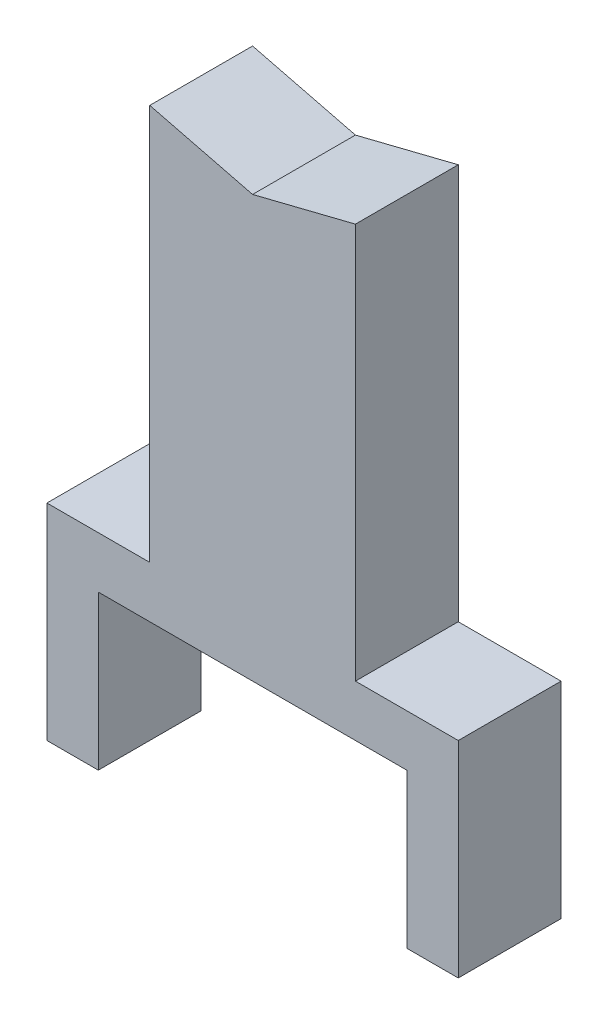
ISO-10303-21;
HEADER;
FILE_DESCRIPTION(('STEP AP214'),'2;1');
FILE_NAME('part.step','',(''),(''),'','','');
FILE_SCHEMA(('AUTOMOTIVE_DESIGN { 1 0 10303 214 1 1 1 1 }'));
ENDSEC;
DATA;
#1=APPLICATION_CONTEXT('core data for automotive mechanical design processes');
#2=APPLICATION_PROTOCOL_DEFINITION('international standard','automotive_design',2000,#1);
#3=PRODUCT_CONTEXT('',#1,'mechanical');
#4=PRODUCT('Part','Part','',(#3));
#5=PRODUCT_RELATED_PRODUCT_CATEGORY('part','',(#4));
#6=PRODUCT_DEFINITION_FORMATION('','',#4);
#7=PRODUCT_DEFINITION_CONTEXT('part definition',#1,'design');
#8=PRODUCT_DEFINITION('design','',#6,#7);
#9=PRODUCT_DEFINITION_SHAPE('','',#8);
#10=(LENGTH_UNIT() NAMED_UNIT(*) SI_UNIT(.MILLI.,.METRE.));
#11=(NAMED_UNIT(*) PLANE_ANGLE_UNIT() SI_UNIT($,.RADIAN.));
#12=(NAMED_UNIT(*) SI_UNIT($,.STERADIAN.) SOLID_ANGLE_UNIT());
#13=UNCERTAINTY_MEASURE_WITH_UNIT(LENGTH_MEASURE(1.E-05),#10,'distance_accuracy_value','');
#14=(GEOMETRIC_REPRESENTATION_CONTEXT(3) GLOBAL_UNCERTAINTY_ASSIGNED_CONTEXT((#13)) GLOBAL_UNIT_ASSIGNED_CONTEXT((#10,
#11,#12)) REPRESENTATION_CONTEXT('',''));
#15=CARTESIAN_POINT('',(0.,0.,0.));
#16=DIRECTION('',(0.,0.,1.));
#17=DIRECTION('',(1.,0.,0.));
#18=AXIS2_PLACEMENT_3D('',#15,#16,#17);
#19=CARTESIAN_POINT('',(0.,76.2,25.4));
#20=DIRECTION('',(0.,1.,0.));
#21=DIRECTION('',(-1.,0.,0.));
#22=AXIS2_PLACEMENT_3D('',#19,#20,#21);
#23=PLANE('',#22);
#24=DIRECTION('',(1.,0.,0.));
#25=VECTOR('',#24,1.);
#26=CARTESIAN_POINT('',(0.,76.2,-25.4));
#27=LINE('',#26,#25);
#28=CARTESIAN_POINT('',(-76.1999999999999,76.2,-25.4));
#29=VERTEX_POINT('',#28);
#30=CARTESIAN_POINT('',(76.2,76.2,-25.4));
#31=VERTEX_POINT('',#30);
#32=EDGE_CURVE('E174',#29,#31,#27,.T.);
#33=ORIENTED_EDGE('',*,*,#32,.T.);
#34=DIRECTION('',(0.,0.,-1.));
#35=VECTOR('',#34,1.);
#36=CARTESIAN_POINT('',(76.2,76.2,25.4));
#37=LINE('',#36,#35);
#38=CARTESIAN_POINT('',(76.2,76.2,25.4));
#39=VERTEX_POINT('',#38);
#40=EDGE_CURVE('E11',#39,#31,#37,.T.);
#41=ORIENTED_EDGE('',*,*,#40,.F.);
#42=DIRECTION('',(1.,0.,0.));
#43=VECTOR('',#42,1.);
#44=CARTESIAN_POINT('',(0.,76.2,25.4));
#45=LINE('',#44,#43);
#46=CARTESIAN_POINT('',(-76.1999999999999,76.2,25.4));
#47=VERTEX_POINT('',#46);
#48=EDGE_CURVE('E113',#47,#39,#45,.T.);
#49=ORIENTED_EDGE('',*,*,#48,.F.);
#50=DIRECTION('',(0.,0.,-1.));
#51=VECTOR('',#50,1.);
#52=CARTESIAN_POINT('',(-76.1999999999999,76.2,25.4));
#53=LINE('',#52,#51);
#54=EDGE_CURVE('E170',#47,#29,#53,.T.);
#55=ORIENTED_EDGE('',*,*,#54,.T.);
#56=EDGE_LOOP('',(#33,#41,#49,#55));
#57=FACE_BOUND('',#56,.T.);
#58=ADVANCED_FACE('F45',(#57),#23,.F.);
#59=CARTESIAN_POINT('',(76.2,0.,25.4));
#60=DIRECTION('',(-1.,0.,0.));
#61=DIRECTION('',(0.,-1.,0.));
#62=AXIS2_PLACEMENT_3D('',#59,#60,#61);
#63=PLANE('',#62);
#64=DIRECTION('',(0.,1.,0.));
#65=VECTOR('',#64,1.);
#66=CARTESIAN_POINT('',(76.2,0.,-25.4));
#67=LINE('',#66,#65);
#68=CARTESIAN_POINT('',(76.2,0.,-25.4));
#69=VERTEX_POINT('',#68);
#70=EDGE_CURVE('E178',#69,#31,#67,.T.);
#71=ORIENTED_EDGE('',*,*,#70,.F.);
#72=DIRECTION('',(0.,0.,-1.));
#73=VECTOR('',#72,1.);
#74=CARTESIAN_POINT('',(76.2,0.,25.4));
#75=LINE('',#74,#73);
#76=CARTESIAN_POINT('',(76.2,0.,25.4));
#77=VERTEX_POINT('',#76);
#78=EDGE_CURVE('E54',#77,#69,#75,.T.);
#79=ORIENTED_EDGE('',*,*,#78,.F.);
#80=DIRECTION('',(0.,1.,0.));
#81=VECTOR('',#80,1.);
#82=CARTESIAN_POINT('',(76.2,0.,25.4));
#83=LINE('',#82,#81);
#84=EDGE_CURVE('E263',#77,#39,#83,.T.);
#85=ORIENTED_EDGE('',*,*,#84,.T.);
#86=ORIENTED_EDGE('',*,*,#40,.T.);
#87=EDGE_LOOP('',(#71,#79,#85,#86));
#88=FACE_BOUND('',#87,.T.);
#89=ADVANCED_FACE('F262',(#88),#63,.T.);
#90=CARTESIAN_POINT('',(0.,0.,25.4));
#91=DIRECTION('',(0.,1.,0.));
#92=DIRECTION('',(-1.,0.,0.));
#93=AXIS2_PLACEMENT_3D('',#90,#91,#92);
#94=PLANE('',#93);
#95=DIRECTION('',(1.,0.,0.));
#96=VECTOR('',#95,1.);
#97=CARTESIAN_POINT('',(0.,0.,-25.4));
#98=LINE('',#97,#96);
#99=CARTESIAN_POINT('',(101.6,0.,-25.4));
#100=VERTEX_POINT('',#99);
#101=EDGE_CURVE('E182',#69,#100,#98,.T.);
#102=ORIENTED_EDGE('',*,*,#101,.T.);
#103=DIRECTION('',(0.,0.,-1.));
#104=VECTOR('',#103,1.);
#105=CARTESIAN_POINT('',(101.6,0.,25.4));
#106=LINE('',#105,#104);
#107=CARTESIAN_POINT('',(101.6,0.,25.4));
#108=VERTEX_POINT('',#107);
#109=EDGE_CURVE('E244',#108,#100,#106,.T.);
#110=ORIENTED_EDGE('',*,*,#109,.F.);
#111=DIRECTION('',(1.,0.,0.));
#112=VECTOR('',#111,1.);
#113=CARTESIAN_POINT('',(0.,0.,25.4));
#114=LINE('',#113,#112);
#115=EDGE_CURVE('E253',#77,#108,#114,.T.);
#116=ORIENTED_EDGE('',*,*,#115,.F.);
#117=ORIENTED_EDGE('',*,*,#78,.T.);
#118=EDGE_LOOP('',(#102,#110,#116,#117));
#119=FACE_BOUND('',#118,.T.);
#120=ADVANCED_FACE('F251',(#119),#94,.F.);
#121=CARTESIAN_POINT('',(101.6,0.,25.4));
#122=DIRECTION('',(-1.,0.,0.));
#123=DIRECTION('',(0.,-1.,0.));
#124=AXIS2_PLACEMENT_3D('',#121,#122,#123);
#125=PLANE('',#124);
#126=DIRECTION('',(0.,1.,0.));
#127=VECTOR('',#126,1.);
#128=CARTESIAN_POINT('',(101.6,0.,-25.4));
#129=LINE('',#128,#127);
#130=CARTESIAN_POINT('',(101.6,101.6,-25.4));
#131=VERTEX_POINT('',#130);
#132=EDGE_CURVE('E185',#100,#131,#129,.T.);
#133=ORIENTED_EDGE('',*,*,#132,.T.);
#134=DIRECTION('',(0.,0.,-1.));
#135=VECTOR('',#134,1.);
#136=CARTESIAN_POINT('',(101.6,101.6,25.4));
#137=LINE('',#136,#135);
#138=CARTESIAN_POINT('',(101.6,101.6,25.4));
#139=VERTEX_POINT('',#138);
#140=EDGE_CURVE('E240',#139,#131,#137,.T.);
#141=ORIENTED_EDGE('',*,*,#140,.F.);
#142=DIRECTION('',(0.,1.,0.));
#143=VECTOR('',#142,1.);
#144=CARTESIAN_POINT('',(101.6,0.,25.4));
#145=LINE('',#144,#143);
#146=EDGE_CURVE('E299',#108,#139,#145,.T.);
#147=ORIENTED_EDGE('',*,*,#146,.F.);
#148=ORIENTED_EDGE('',*,*,#109,.T.);
#149=EDGE_LOOP('',(#133,#141,#147,#148));
#150=FACE_BOUND('',#149,.T.);
#151=ADVANCED_FACE('F298',(#150),#125,.F.);
#152=CARTESIAN_POINT('',(3.88578058618806E-13,101.6,25.4));
#153=DIRECTION('',(0.,-1.,0.));
#154=DIRECTION('',(1.,0.,0.));
#155=AXIS2_PLACEMENT_3D('',#152,#153,#154);
#156=PLANE('',#155);
#157=DIRECTION('',(-1.,0.,0.));
#158=VECTOR('',#157,1.);
#159=CARTESIAN_POINT('',(3.88578058618806E-13,101.6,-25.4));
#160=LINE('',#159,#158);
#161=CARTESIAN_POINT('',(50.7999999999999,101.6,-25.4));
#162=VERTEX_POINT('',#161);
#163=EDGE_CURVE('E188',#131,#162,#160,.T.);
#164=ORIENTED_EDGE('',*,*,#163,.T.);
#165=DIRECTION('',(0.,0.,-1.));
#166=VECTOR('',#165,1.);
#167=CARTESIAN_POINT('',(50.7999999999999,101.6,25.4));
#168=LINE('',#167,#166);
#169=CARTESIAN_POINT('',(50.7999999999999,101.6,25.4));
#170=VERTEX_POINT('',#169);
#171=EDGE_CURVE('E236',#170,#162,#168,.T.);
#172=ORIENTED_EDGE('',*,*,#171,.F.);
#173=DIRECTION('',(-1.,0.,0.));
#174=VECTOR('',#173,1.);
#175=CARTESIAN_POINT('',(3.88578058618806E-13,101.6,25.4));
#176=LINE('',#175,#174);
#177=EDGE_CURVE('E294',#139,#170,#176,.T.);
#178=ORIENTED_EDGE('',*,*,#177,.F.);
#179=ORIENTED_EDGE('',*,*,#140,.T.);
#180=EDGE_LOOP('',(#164,#172,#178,#179));
#181=FACE_BOUND('',#180,.T.);
#182=ADVANCED_FACE('F293',(#181),#156,.F.);
#183=CARTESIAN_POINT('',(50.7999999999999,0.,25.4));
#184=DIRECTION('',(-1.,0.,0.));
#185=DIRECTION('',(0.,-1.,0.));
#186=AXIS2_PLACEMENT_3D('',#183,#184,#185);
#187=PLANE('',#186);
#188=DIRECTION('',(0.,1.,0.));
#189=VECTOR('',#188,1.);
#190=CARTESIAN_POINT('',(50.7999999999999,0.,-25.4));
#191=LINE('',#190,#189);
#192=CARTESIAN_POINT('',(50.8,297.1038,-25.4));
#193=VERTEX_POINT('',#192);
#194=EDGE_CURVE('E191',#162,#193,#191,.T.);
#195=ORIENTED_EDGE('',*,*,#194,.T.);
#196=DIRECTION('',(0.,0.,-1.));
#197=VECTOR('',#196,1.);
#198=CARTESIAN_POINT('',(50.8,297.1038,25.4));
#199=LINE('',#198,#197);
#200=CARTESIAN_POINT('',(50.8,297.1038,25.4));
#201=VERTEX_POINT('',#200);
#202=EDGE_CURVE('E233',#201,#193,#199,.T.);
#203=ORIENTED_EDGE('',*,*,#202,.F.);
#204=DIRECTION('',(0.,1.,0.));
#205=VECTOR('',#204,1.);
#206=CARTESIAN_POINT('',(50.7999999999999,0.,25.4));
#207=LINE('',#206,#205);
#208=EDGE_CURVE('E290',#170,#201,#207,.T.);
#209=ORIENTED_EDGE('',*,*,#208,.F.);
#210=ORIENTED_EDGE('',*,*,#171,.T.);
#211=EDGE_LOOP('',(#195,#203,#209,#210));
#212=FACE_BOUND('',#211,.T.);
#213=ADVANCED_FACE('F288',(#212),#187,.F.);
#214=CARTESIAN_POINT('',(-66.9185411764706,267.674164705882,25.4));
#215=DIRECTION('',(-0.242535625036333,0.970142500145332,0.));
#216=DIRECTION('',(-0.970142500145332,-0.242535625036333,0.));
#217=AXIS2_PLACEMENT_3D('',#214,#215,#216);
#218=PLANE('',#217);
#219=DIRECTION('',(0.970142500145332,0.242535625036333,0.));
#220=VECTOR('',#219,1.);
#221=CARTESIAN_POINT('',(-66.9185411764706,267.674164705882,-25.4));
#222=LINE('',#221,#220);
#223=CARTESIAN_POINT('',(0.,284.4038,-25.4));
#224=VERTEX_POINT('',#223);
#225=EDGE_CURVE('E195',#224,#193,#222,.T.);
#226=ORIENTED_EDGE('',*,*,#225,.F.);
#227=DIRECTION('',(0.,0.,-1.));
#228=VECTOR('',#227,1.);
#229=CARTESIAN_POINT('',(0.,284.4038,25.4));
#230=LINE('',#229,#228);
#231=CARTESIAN_POINT('',(0.,284.4038,25.4));
#232=VERTEX_POINT('',#231);
#233=EDGE_CURVE('E230',#232,#224,#230,.T.);
#234=ORIENTED_EDGE('',*,*,#233,.F.);
#235=DIRECTION('',(0.970142500145332,0.242535625036333,0.));
#236=VECTOR('',#235,1.);
#237=CARTESIAN_POINT('',(-66.9185411764706,267.674164705882,25.4));
#238=LINE('',#237,#236);
#239=EDGE_CURVE('E285',#232,#201,#238,.T.);
#240=ORIENTED_EDGE('',*,*,#239,.T.);
#241=ORIENTED_EDGE('',*,*,#202,.T.);
#242=EDGE_LOOP('',(#226,#234,#240,#241));
#243=FACE_BOUND('',#242,.T.);
#244=ADVANCED_FACE('F281',(#243),#218,.T.);
#245=CARTESIAN_POINT('',(66.9185411764706,267.674164705882,25.4));
#246=DIRECTION('',(0.242535625036333,0.970142500145332,0.));
#247=DIRECTION('',(-0.970142500145332,0.242535625036333,0.));
#248=AXIS2_PLACEMENT_3D('',#245,#246,#247);
#249=PLANE('',#248);
#250=DIRECTION('',(0.970142500145332,-0.242535625036333,0.));
#251=VECTOR('',#250,1.);
#252=CARTESIAN_POINT('',(66.9185411764706,267.674164705882,-25.4));
#253=LINE('',#252,#251);
#254=CARTESIAN_POINT('',(-50.8,297.1038,-25.4));
#255=VERTEX_POINT('',#254);
#256=EDGE_CURVE('E199',#255,#224,#253,.T.);
#257=ORIENTED_EDGE('',*,*,#256,.F.);
#258=DIRECTION('',(0.,0.,-1.));
#259=VECTOR('',#258,1.);
#260=CARTESIAN_POINT('',(-50.8,297.1038,25.4));
#261=LINE('',#260,#259);
#262=CARTESIAN_POINT('',(-50.8,297.1038,25.4));
#263=VERTEX_POINT('',#262);
#264=EDGE_CURVE('E227',#263,#255,#261,.T.);
#265=ORIENTED_EDGE('',*,*,#264,.F.);
#266=DIRECTION('',(0.970142500145332,-0.242535625036333,0.));
#267=VECTOR('',#266,1.);
#268=CARTESIAN_POINT('',(66.9185411764706,267.674164705882,25.4));
#269=LINE('',#268,#267);
#270=EDGE_CURVE('E312',#263,#232,#269,.T.);
#271=ORIENTED_EDGE('',*,*,#270,.T.);
#272=ORIENTED_EDGE('',*,*,#233,.T.);
#273=EDGE_LOOP('',(#257,#265,#271,#272));
#274=FACE_BOUND('',#273,.T.);
#275=ADVANCED_FACE('F277',(#274),#249,.T.);
#276=CARTESIAN_POINT('',(-50.7999999999999,0.,25.4));
#277=DIRECTION('',(-1.,0.,0.));
#278=DIRECTION('',(0.,-1.,0.));
#279=AXIS2_PLACEMENT_3D('',#276,#277,#278);
#280=PLANE('',#279);
#281=DIRECTION('',(0.,1.,0.));
#282=VECTOR('',#281,1.);
#283=CARTESIAN_POINT('',(-50.7999999999999,0.,-25.4));
#284=LINE('',#283,#282);
#285=CARTESIAN_POINT('',(-50.7999999999999,101.6,-25.4));
#286=VERTEX_POINT('',#285);
#287=EDGE_CURVE('E203',#286,#255,#284,.T.);
#288=ORIENTED_EDGE('',*,*,#287,.F.);
#289=DIRECTION('',(0.,0.,-1.));
#290=VECTOR('',#289,1.);
#291=CARTESIAN_POINT('',(-50.7999999999999,101.6,25.4));
#292=LINE('',#291,#290);
#293=CARTESIAN_POINT('',(-50.7999999999999,101.6,25.4));
#294=VERTEX_POINT('',#293);
#295=EDGE_CURVE('E224',#294,#286,#292,.T.);
#296=ORIENTED_EDGE('',*,*,#295,.F.);
#297=DIRECTION('',(0.,1.,0.));
#298=VECTOR('',#297,1.);
#299=CARTESIAN_POINT('',(-50.7999999999999,0.,25.4));
#300=LINE('',#299,#298);
#301=EDGE_CURVE('E273',#294,#263,#300,.T.);
#302=ORIENTED_EDGE('',*,*,#301,.T.);
#303=ORIENTED_EDGE('',*,*,#264,.T.);
#304=EDGE_LOOP('',(#288,#296,#302,#303));
#305=FACE_BOUND('',#304,.T.);
#306=ADVANCED_FACE('F271',(#305),#280,.T.);
#307=CARTESIAN_POINT('',(0.,101.6,25.4));
#308=DIRECTION('',(0.,1.,0.));
#309=DIRECTION('',(0.,0.,1.));
#310=AXIS2_PLACEMENT_3D('',#307,#308,#309);
#311=PLANE('',#310);
#312=DIRECTION('',(1.,0.,0.));
#313=VECTOR('',#312,1.);
#314=CARTESIAN_POINT('',(0.,101.6,-25.4));
#315=LINE('',#314,#313);
#316=CARTESIAN_POINT('',(-101.6,101.6,-25.4));
#317=VERTEX_POINT('',#316);
#318=EDGE_CURVE('E207',#317,#286,#315,.T.);
#319=ORIENTED_EDGE('',*,*,#318,.F.);
#320=DIRECTION('',(0.,0.,-1.));
#321=VECTOR('',#320,1.);
#322=CARTESIAN_POINT('',(-101.6,101.6,25.4));
#323=LINE('',#322,#321);
#324=CARTESIAN_POINT('',(-101.6,101.6,25.4));
#325=VERTEX_POINT('',#324);
#326=EDGE_CURVE('E156',#325,#317,#323,.T.);
#327=ORIENTED_EDGE('',*,*,#326,.F.);
#328=DIRECTION('',(1.,0.,0.));
#329=VECTOR('',#328,1.);
#330=CARTESIAN_POINT('',(0.,101.6,25.4));
#331=LINE('',#330,#329);
#332=EDGE_CURVE('E163',#325,#294,#331,.T.);
#333=ORIENTED_EDGE('',*,*,#332,.T.);
#334=ORIENTED_EDGE('',*,*,#295,.T.);
#335=EDGE_LOOP('',(#319,#327,#333,#334));
#336=FACE_BOUND('',#335,.T.);
#337=ADVANCED_FACE('F268',(#336),#311,.T.);
#338=CARTESIAN_POINT('',(-101.6,0.,25.4));
#339=DIRECTION('',(-1.,0.,0.));
#340=DIRECTION('',(0.,0.,1.));
#341=AXIS2_PLACEMENT_3D('',#338,#339,#340);
#342=PLANE('',#341);
#343=DIRECTION('',(0.,1.,0.));
#344=VECTOR('',#343,1.);
#345=CARTESIAN_POINT('',(-101.6,0.,-25.4));
#346=LINE('',#345,#344);
#347=CARTESIAN_POINT('',(-101.6,0.,-25.4));
#348=VERTEX_POINT('',#347);
#349=EDGE_CURVE('E150',#348,#317,#346,.T.);
#350=ORIENTED_EDGE('',*,*,#349,.F.);
#351=DIRECTION('',(0.,0.,-1.));
#352=VECTOR('',#351,1.);
#353=CARTESIAN_POINT('',(-101.6,0.,25.4));
#354=LINE('',#353,#352);
#355=CARTESIAN_POINT('',(-101.6,0.,25.4));
#356=VERTEX_POINT('',#355);
#357=EDGE_CURVE('E145',#356,#348,#354,.T.);
#358=ORIENTED_EDGE('',*,*,#357,.F.);
#359=DIRECTION('',(0.,1.,0.));
#360=VECTOR('',#359,1.);
#361=CARTESIAN_POINT('',(-101.6,0.,25.4));
#362=LINE('',#361,#360);
#363=EDGE_CURVE('E148',#356,#325,#362,.T.);
#364=ORIENTED_EDGE('',*,*,#363,.T.);
#365=ORIENTED_EDGE('',*,*,#326,.T.);
#366=EDGE_LOOP('',(#350,#358,#364,#365));
#367=FACE_BOUND('',#366,.T.);
#368=ADVANCED_FACE('F147',(#367),#342,.T.);
#369=CARTESIAN_POINT('',(0.,0.,25.4));
#370=DIRECTION('',(0.,-1.,0.));
#371=DIRECTION('',(1.,0.,0.));
#372=AXIS2_PLACEMENT_3D('',#369,#370,#371);
#373=PLANE('',#372);
#374=DIRECTION('',(-1.,0.,0.));
#375=VECTOR('',#374,1.);
#376=CARTESIAN_POINT('',(0.,0.,-25.4));
#377=LINE('',#376,#375);
#378=CARTESIAN_POINT('',(-76.1999999999999,0.,-25.4));
#379=VERTEX_POINT('',#378);
#380=EDGE_CURVE('E213',#379,#348,#377,.T.);
#381=ORIENTED_EDGE('',*,*,#380,.F.);
#382=DIRECTION('',(0.,0.,-1.));
#383=VECTOR('',#382,1.);
#384=CARTESIAN_POINT('',(-76.1999999999999,0.,25.4));
#385=LINE('',#384,#383);
#386=CARTESIAN_POINT('',(-76.1999999999999,0.,25.4));
#387=VERTEX_POINT('',#386);
#388=EDGE_CURVE('E104',#387,#379,#385,.T.);
#389=ORIENTED_EDGE('',*,*,#388,.F.);
#390=DIRECTION('',(-1.,0.,0.));
#391=VECTOR('',#390,1.);
#392=CARTESIAN_POINT('',(0.,0.,25.4));
#393=LINE('',#392,#391);
#394=EDGE_CURVE('E160',#387,#356,#393,.T.);
#395=ORIENTED_EDGE('',*,*,#394,.T.);
#396=ORIENTED_EDGE('',*,*,#357,.T.);
#397=EDGE_LOOP('',(#381,#389,#395,#396));
#398=FACE_BOUND('',#397,.T.);
#399=ADVANCED_FACE('F166',(#398),#373,.T.);
#400=CARTESIAN_POINT('',(-76.1999999999999,0.,25.4));
#401=DIRECTION('',(-1.,0.,0.));
#402=DIRECTION('',(0.,-1.,0.));
#403=AXIS2_PLACEMENT_3D('',#400,#401,#402);
#404=PLANE('',#403);
#405=DIRECTION('',(0.,1.,0.));
#406=VECTOR('',#405,1.);
#407=CARTESIAN_POINT('',(-76.1999999999999,0.,-25.4));
#408=LINE('',#407,#406);
#409=EDGE_CURVE('E107',#379,#29,#408,.T.);
#410=ORIENTED_EDGE('',*,*,#409,.T.);
#411=ORIENTED_EDGE('',*,*,#54,.F.);
#412=DIRECTION('',(0.,1.,0.));
#413=VECTOR('',#412,1.);
#414=CARTESIAN_POINT('',(-76.1999999999999,0.,25.4));
#415=LINE('',#414,#413);
#416=EDGE_CURVE('E62',#387,#47,#415,.T.);
#417=ORIENTED_EDGE('',*,*,#416,.F.);
#418=ORIENTED_EDGE('',*,*,#388,.T.);
#419=EDGE_LOOP('',(#410,#411,#417,#418));
#420=FACE_BOUND('',#419,.T.);
#421=ADVANCED_FACE('F414',(#420),#404,.F.);
#422=CARTESIAN_POINT('',(0.,0.,25.4));
#423=DIRECTION('',(0.,0.,1.));
#424=DIRECTION('',(1.,0.,0.));
#425=AXIS2_PLACEMENT_3D('',#422,#423,#424);
#426=PLANE('',#425);
#427=ORIENTED_EDGE('',*,*,#48,.T.);
#428=ORIENTED_EDGE('',*,*,#84,.F.);
#429=ORIENTED_EDGE('',*,*,#115,.T.);
#430=ORIENTED_EDGE('',*,*,#146,.T.);
#431=ORIENTED_EDGE('',*,*,#177,.T.);
#432=ORIENTED_EDGE('',*,*,#208,.T.);
#433=ORIENTED_EDGE('',*,*,#239,.F.);
#434=ORIENTED_EDGE('',*,*,#270,.F.);
#435=ORIENTED_EDGE('',*,*,#301,.F.);
#436=ORIENTED_EDGE('',*,*,#332,.F.);
#437=ORIENTED_EDGE('',*,*,#363,.F.);
#438=ORIENTED_EDGE('',*,*,#394,.F.);
#439=ORIENTED_EDGE('',*,*,#416,.T.);
#440=EDGE_LOOP('',(#427,#428,#429,#430,#431,#432,#433,#434,#435,#436,#437,#438,#439));
#441=FACE_BOUND('',#440,.T.);
#442=ADVANCED_FACE('F159',(#441),#426,.T.);
#443=CARTESIAN_POINT('',(0.,0.,-25.4));
#444=DIRECTION('',(0.,0.,1.));
#445=DIRECTION('',(1.,0.,0.));
#446=AXIS2_PLACEMENT_3D('',#443,#444,#445);
#447=PLANE('',#446);
#448=ORIENTED_EDGE('',*,*,#32,.F.);
#449=ORIENTED_EDGE('',*,*,#409,.F.);
#450=ORIENTED_EDGE('',*,*,#380,.T.);
#451=ORIENTED_EDGE('',*,*,#349,.T.);
#452=ORIENTED_EDGE('',*,*,#318,.T.);
#453=ORIENTED_EDGE('',*,*,#287,.T.);
#454=ORIENTED_EDGE('',*,*,#256,.T.);
#455=ORIENTED_EDGE('',*,*,#225,.T.);
#456=ORIENTED_EDGE('',*,*,#194,.F.);
#457=ORIENTED_EDGE('',*,*,#163,.F.);
#458=ORIENTED_EDGE('',*,*,#132,.F.);
#459=ORIENTED_EDGE('',*,*,#101,.F.);
#460=ORIENTED_EDGE('',*,*,#70,.T.);
#461=EDGE_LOOP('',(#448,#449,#450,#451,#452,#453,#454,#455,#456,#457,#458,#459,#460));
#462=FACE_BOUND('',#461,.T.);
#463=ADVANCED_FACE('F260',(#462),#447,.F.);
#464=CLOSED_SHELL('',(#58,#89,#120,#151,#182,#213,#244,#275,#306,#337,#368,#399,#421,#442,#463));
#465=MANIFOLD_SOLID_BREP('B2',#464);
#466=ADVANCED_BREP_SHAPE_REPRESENTATION('',(#18,#465),#14);
#467=SHAPE_DEFINITION_REPRESENTATION(#9,#466);
ENDSEC;
END-ISO-10303-21;
